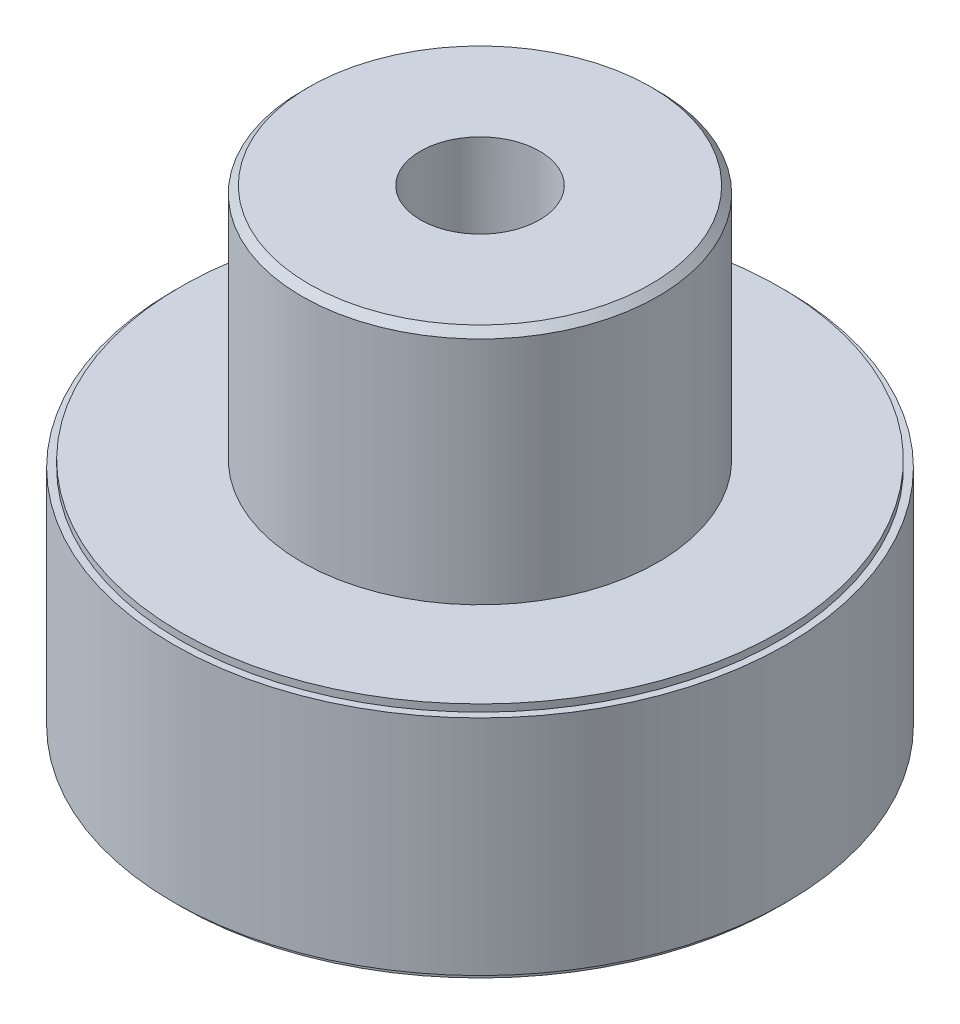
ISO-10303-21;
HEADER;
FILE_DESCRIPTION(('STEP AP214'),'2;1');
FILE_NAME('part.step','',(''),(''),'','','');
FILE_SCHEMA(('AUTOMOTIVE_DESIGN { 1 0 10303 214 1 1 1 1 }'));
ENDSEC;
DATA;
#1=APPLICATION_CONTEXT('core data for automotive mechanical design processes');
#2=APPLICATION_PROTOCOL_DEFINITION('international standard','automotive_design',2000,#1);
#3=PRODUCT_CONTEXT('',#1,'mechanical');
#4=PRODUCT('Part','Part','',(#3));
#5=PRODUCT_RELATED_PRODUCT_CATEGORY('part','',(#4));
#6=PRODUCT_DEFINITION_FORMATION('','',#4);
#7=PRODUCT_DEFINITION_CONTEXT('part definition',#1,'design');
#8=PRODUCT_DEFINITION('design','',#6,#7);
#9=PRODUCT_DEFINITION_SHAPE('','',#8);
#10=(LENGTH_UNIT() NAMED_UNIT(*) SI_UNIT(.MILLI.,.METRE.));
#11=(NAMED_UNIT(*) PLANE_ANGLE_UNIT() SI_UNIT($,.RADIAN.));
#12=(NAMED_UNIT(*) SI_UNIT($,.STERADIAN.) SOLID_ANGLE_UNIT());
#13=UNCERTAINTY_MEASURE_WITH_UNIT(LENGTH_MEASURE(1.E-05),#10,'distance_accuracy_value','');
#14=(GEOMETRIC_REPRESENTATION_CONTEXT(3) GLOBAL_UNCERTAINTY_ASSIGNED_CONTEXT((#13)) GLOBAL_UNIT_ASSIGNED_CONTEXT((#10,
#11,#12)) REPRESENTATION_CONTEXT('',''));
#15=CARTESIAN_POINT('',(0.,0.,0.));
#16=DIRECTION('',(0.,0.,1.));
#17=DIRECTION('',(1.,0.,0.));
#18=AXIS2_PLACEMENT_3D('',#15,#16,#17);
#19=CARTESIAN_POINT('',(0.,12.7,0.));
#20=DIRECTION('',(0.,1.,0.));
#21=DIRECTION('',(0.,0.,1.));
#22=AXIS2_PLACEMENT_3D('',#19,#20,#21);
#23=PLANE('',#22);
#24=CARTESIAN_POINT('',(0.,12.7,0.));
#25=DIRECTION('',(0.,1.,0.));
#26=DIRECTION('',(0.,0.,1.));
#27=AXIS2_PLACEMENT_3D('',#24,#25,#26);
#28=CIRCLE('',#27,16.02);
#29=CARTESIAN_POINT('',(0.,12.7,16.02));
#30=VERTEX_POINT('',#29);
#31=EDGE_CURVE('E53',#30,#30,#28,.T.);
#32=ORIENTED_EDGE('',*,*,#31,.T.);
#33=EDGE_LOOP('',(#32));
#34=FACE_BOUND('',#33,.T.);
#35=CARTESIAN_POINT('',(0.,12.7,0.));
#36=DIRECTION('',(0.,1.,0.));
#37=DIRECTION('',(0.,0.,1.));
#38=AXIS2_PLACEMENT_3D('',#35,#36,#37);
#39=CIRCLE('',#38,9.525);
#40=CARTESIAN_POINT('',(0.,12.7,9.525));
#41=VERTEX_POINT('',#40);
#42=EDGE_CURVE('E62',#41,#41,#39,.T.);
#43=ORIENTED_EDGE('',*,*,#42,.F.);
#44=EDGE_LOOP('',(#43));
#45=FACE_BOUND('',#44,.T.);
#46=ADVANCED_FACE('F31',(#34,#45),#23,.T.);
#47=CARTESIAN_POINT('',(0.,12.32,0.));
#48=DIRECTION('',(0.,1.,0.));
#49=DIRECTION('',(0.,0.,1.));
#50=AXIS2_PLACEMENT_3D('',#47,#48,#49);
#51=PLANE('',#50);
#52=CARTESIAN_POINT('',(0.,12.32,0.));
#53=DIRECTION('',(0.,1.,0.));
#54=DIRECTION('',(0.,0.,1.));
#55=AXIS2_PLACEMENT_3D('',#52,#53,#54);
#56=CIRCLE('',#55,16.4);
#57=CARTESIAN_POINT('',(0.,12.32,16.4));
#58=VERTEX_POINT('',#57);
#59=EDGE_CURVE('E48',#58,#58,#56,.T.);
#60=ORIENTED_EDGE('',*,*,#59,.T.);
#61=EDGE_LOOP('',(#60));
#62=FACE_BOUND('',#61,.T.);
#63=CARTESIAN_POINT('',(0.,12.32,0.));
#64=DIRECTION('',(0.,1.,0.));
#65=DIRECTION('',(0.,0.,1.));
#66=AXIS2_PLACEMENT_3D('',#63,#64,#65);
#67=CIRCLE('',#66,16.02);
#68=CARTESIAN_POINT('',(0.,12.32,16.02));
#69=VERTEX_POINT('',#68);
#70=EDGE_CURVE('E56',#69,#69,#67,.T.);
#71=ORIENTED_EDGE('',*,*,#70,.F.);
#72=EDGE_LOOP('',(#71));
#73=FACE_BOUND('',#72,.T.);
#74=ADVANCED_FACE('F130',(#62,#73),#51,.T.);
#75=CARTESIAN_POINT('',(0.,0.38,0.));
#76=DIRECTION('',(0.,-1.,0.));
#77=DIRECTION('',(0.,0.,-1.));
#78=AXIS2_PLACEMENT_3D('',#75,#76,#77);
#79=CYLINDRICAL_SURFACE('',#78,16.02);
#80=CARTESIAN_POINT('',(0.,0.38,0.));
#81=DIRECTION('',(0.,1.,0.));
#82=DIRECTION('',(0.,0.,1.));
#83=AXIS2_PLACEMENT_3D('',#80,#81,#82);
#84=CIRCLE('',#83,16.02);
#85=CARTESIAN_POINT('',(0.,0.38,16.02));
#86=VERTEX_POINT('',#85);
#87=EDGE_CURVE('E10',#86,#86,#84,.T.);
#88=ORIENTED_EDGE('',*,*,#87,.F.);
#89=EDGE_LOOP('',(#88));
#90=FACE_BOUND('',#89,.T.);
#91=CARTESIAN_POINT('',(0.,0.,0.));
#92=DIRECTION('',(0.,1.,0.));
#93=DIRECTION('',(0.,0.,1.));
#94=AXIS2_PLACEMENT_3D('',#91,#92,#93);
#95=CIRCLE('',#94,16.02);
#96=CARTESIAN_POINT('',(0.,0.,16.02));
#97=VERTEX_POINT('',#96);
#98=EDGE_CURVE('E43',#97,#97,#95,.T.);
#99=ORIENTED_EDGE('',*,*,#98,.T.);
#100=EDGE_LOOP('',(#99));
#101=FACE_BOUND('',#100,.T.);
#102=ADVANCED_FACE('F33',(#90,#101),#79,.T.);
#103=CARTESIAN_POINT('',(0.,0.,0.));
#104=DIRECTION('',(0.,1.,0.));
#105=DIRECTION('',(0.,0.,1.));
#106=AXIS2_PLACEMENT_3D('',#103,#104,#105);
#107=PLANE('',#106);
#108=CARTESIAN_POINT('',(0.,0.,0.));
#109=DIRECTION('',(0.,1.,0.));
#110=DIRECTION('',(0.,0.,1.));
#111=AXIS2_PLACEMENT_3D('',#108,#109,#110);
#112=CIRCLE('',#111,12.7);
#113=CARTESIAN_POINT('',(0.,0.,12.7));
#114=VERTEX_POINT('',#113);
#115=EDGE_CURVE('E79',#114,#114,#112,.T.);
#116=ORIENTED_EDGE('',*,*,#115,.T.);
#117=EDGE_LOOP('',(#116));
#118=FACE_BOUND('',#117,.T.);
#119=ORIENTED_EDGE('',*,*,#98,.F.);
#120=EDGE_LOOP('',(#119));
#121=FACE_BOUND('',#120,.T.);
#122=ADVANCED_FACE('F146',(#118,#121),#107,.F.);
#123=CARTESIAN_POINT('',(0.,0.38,0.));
#124=DIRECTION('',(0.,1.,0.));
#125=DIRECTION('',(0.,0.,1.));
#126=AXIS2_PLACEMENT_3D('',#123,#124,#125);
#127=PLANE('',#126);
#128=CARTESIAN_POINT('',(0.,0.38,0.));
#129=DIRECTION('',(0.,1.,0.));
#130=DIRECTION('',(0.,0.,1.));
#131=AXIS2_PLACEMENT_3D('',#128,#129,#130);
#132=CIRCLE('',#131,16.4);
#133=CARTESIAN_POINT('',(0.,0.38,16.4));
#134=VERTEX_POINT('',#133);
#135=EDGE_CURVE('E50',#134,#134,#132,.T.);
#136=ORIENTED_EDGE('',*,*,#135,.F.);
#137=EDGE_LOOP('',(#136));
#138=FACE_BOUND('',#137,.T.);
#139=ORIENTED_EDGE('',*,*,#87,.T.);
#140=EDGE_LOOP('',(#139));
#141=FACE_BOUND('',#140,.T.);
#142=ADVANCED_FACE('F143',(#138,#141),#127,.F.);
#143=CARTESIAN_POINT('',(0.,12.32,0.));
#144=DIRECTION('',(0.,-1.,0.));
#145=DIRECTION('',(0.,0.,-1.));
#146=AXIS2_PLACEMENT_3D('',#143,#144,#145);
#147=CYLINDRICAL_SURFACE('',#146,16.4);
#148=ORIENTED_EDGE('',*,*,#59,.F.);
#149=EDGE_LOOP('',(#148));
#150=FACE_BOUND('',#149,.T.);
#151=ORIENTED_EDGE('',*,*,#135,.T.);
#152=EDGE_LOOP('',(#151));
#153=FACE_BOUND('',#152,.T.);
#154=ADVANCED_FACE('F140',(#150,#153),#147,.T.);
#155=CARTESIAN_POINT('',(0.,12.7,0.));
#156=DIRECTION('',(0.,-1.,0.));
#157=DIRECTION('',(0.,0.,-1.));
#158=AXIS2_PLACEMENT_3D('',#155,#156,#157);
#159=CYLINDRICAL_SURFACE('',#158,16.02);
#160=ORIENTED_EDGE('',*,*,#31,.F.);
#161=EDGE_LOOP('',(#160));
#162=FACE_BOUND('',#161,.T.);
#163=ORIENTED_EDGE('',*,*,#70,.T.);
#164=EDGE_LOOP('',(#163));
#165=FACE_BOUND('',#164,.T.);
#166=ADVANCED_FACE('F125',(#162,#165),#159,.T.);
#167=CARTESIAN_POINT('',(0.,25.02,0.));
#168=DIRECTION('',(0.,-1.,0.));
#169=DIRECTION('',(0.,0.,-1.));
#170=AXIS2_PLACEMENT_3D('',#167,#168,#169);
#171=CYLINDRICAL_SURFACE('',#170,9.525);
#172=CARTESIAN_POINT('',(0.,20.88,-9.525));
#173=CARTESIAN_POINT('',(-0.112118729840977,20.8799960576349,-9.52499792484135));
#174=CARTESIAN_POINT('',(-0.224285882542196,20.870633863567,-9.52300018602881));
#175=CARTESIAN_POINT('',(-0.445439789810249,20.8334679858441,-9.51522366929871));
#176=CARTESIAN_POINT('',(-0.554424116062384,20.8056505868484,-9.50944207938268));
#177=CARTESIAN_POINT('',(-0.765983763596489,20.7324802448237,-9.49474227650881));
#178=CARTESIAN_POINT('',(-0.868565456041813,20.6871450673453,-9.48582724214025));
#179=CARTESIAN_POINT('',(-1.06466167543459,20.5802811627353,-9.46582526780019));
#180=CARTESIAN_POINT('',(-1.15817654724818,20.51875305185,-9.45473841048476));
#181=CARTESIAN_POINT('',(-1.33490489547487,20.3802636493741,-9.43142177798087));
#182=CARTESIAN_POINT('',(-1.41796144256465,20.3031043463361,-9.41917854029123));
#183=CARTESIAN_POINT('',(-1.57005543122941,20.1359681356262,-9.39502500836399));
#184=CARTESIAN_POINT('',(-1.63909168135584,20.045990139723,-9.38311474249653));
#185=CARTESIAN_POINT('',(-1.76186886482662,19.8546218556228,-9.3608434323561));
#186=CARTESIAN_POINT('',(-1.81544440068863,19.7531232627158,-9.35049966570283));
#187=CARTESIAN_POINT('',(-1.90471889803238,19.5423084342172,-9.33272503047548));
#188=CARTESIAN_POINT('',(-1.94041986004639,19.4329930750481,-9.32529383594493));
#189=CARTESIAN_POINT('',(-1.99241648925041,19.2113451132232,-9.31432252800064));
#190=CARTESIAN_POINT('',(-2.00898910085746,19.0990802828613,-9.31072694130865));
#191=CARTESIAN_POINT('',(-2.02311938992197,18.8733105237592,-9.30766722056046));
#192=CARTESIAN_POINT('',(-2.02067926012294,18.7598057395308,-9.30820261007782));
#193=CARTESIAN_POINT('',(-1.99707658150671,18.5368249004084,-9.31329406143002));
#194=CARTESIAN_POINT('',(-1.97623419226569,18.4273131498611,-9.31778136512509));
#195=CARTESIAN_POINT('',(-1.91692518045701,18.2133768396229,-9.3301624926053));
#196=CARTESIAN_POINT('',(-1.87845762246356,18.1089525502659,-9.33805649719398));
#197=CARTESIAN_POINT('',(-1.78469199210292,17.9072471041554,-9.35643025294113));
#198=CARTESIAN_POINT('',(-1.72926943428993,17.8100256201129,-9.36692901697608));
#199=CARTESIAN_POINT('',(-1.60325468594678,17.6261436092519,-9.38931748894697));
#200=CARTESIAN_POINT('',(-1.53266054537303,17.5394844422818,-9.40120737559799));
#201=CARTESIAN_POINT('',(-1.37660468657699,17.3773422052728,-9.42533446698096));
#202=CARTESIAN_POINT('',(-1.29087035090688,17.3021215949858,-9.43757382373047));
#203=CARTESIAN_POINT('',(-1.10786736773257,17.1670850622776,-9.46080063970167));
#204=CARTESIAN_POINT('',(-1.01059853489063,17.1072693874339,-9.47178807880183));
#205=CARTESIAN_POINT('',(-0.806977841115674,17.0046818108476,-9.49130544797007));
#206=CARTESIAN_POINT('',(-0.700608978846047,16.9619426959927,-9.4998306419322));
#207=CARTESIAN_POINT('',(-0.481978931442427,16.8950162952189,-9.51342751758681));
#208=CARTESIAN_POINT('',(-0.369718552968772,16.8708264765931,-9.51849967074425));
#209=CARTESIAN_POINT('',(-0.1447449252677,16.8420633579262,-9.52455239159244));
#210=CARTESIAN_POINT('',(-0.0320794977117327,16.8371312992975,-9.52560777928885));
#211=CARTESIAN_POINT('',(0.192465416506247,16.8460535752304,-9.52371704751969));
#212=CARTESIAN_POINT('',(0.304344952668881,16.8599067157154,-9.52077118239276));
#213=CARTESIAN_POINT('',(0.522964972511826,16.9057084331514,-9.51125601781325));
#214=CARTESIAN_POINT('',(0.629746337759209,16.9374703306318,-9.50472411711296));
#215=CARTESIAN_POINT('',(0.836466569029961,17.017981925958,-9.48876739223556));
#216=CARTESIAN_POINT('',(0.936404875957305,17.0667330098886,-9.47934233202376));
#217=CARTESIAN_POINT('',(1.12809640179785,17.1805970179649,-9.45845945290722));
#218=CARTESIAN_POINT('',(1.21972042204546,17.2459226138616,-9.44697583008331));
#219=CARTESIAN_POINT('',(1.39083463775514,17.3907995393568,-9.42330509750831));
#220=CARTESIAN_POINT('',(1.4703233560168,17.4703525982739,-9.41111790236155));
#221=CARTESIAN_POINT('',(1.61631672557934,17.6430679057469,-9.3871574188698));
#222=CARTESIAN_POINT('',(1.6825737035749,17.7364412721034,-9.37539489927225));
#223=CARTESIAN_POINT('',(1.79846582202227,17.9332017293712,-9.3538566562662));
#224=CARTESIAN_POINT('',(1.8481016651961,18.0365883966934,-9.3440808488687));
#225=CARTESIAN_POINT('',(1.92901804380533,18.2498959495991,-9.32771249367679));
#226=CARTESIAN_POINT('',(1.96039924436973,18.3597772466992,-9.32110252428936));
#227=CARTESIAN_POINT('',(2.00421455226942,18.5834103919382,-9.31178070629733));
#228=CARTESIAN_POINT('',(2.01665148220984,18.6971616608874,-9.30906827698144));
#229=CARTESIAN_POINT('',(2.02211072834025,18.9228125378909,-9.30788367303269));
#230=CARTESIAN_POINT('',(2.01552522832778,19.0347023885508,-9.30932584175886));
#231=CARTESIAN_POINT('',(1.98399922386447,19.255739682418,-9.31609507134074));
#232=CARTESIAN_POINT('',(1.95905890946518,19.3648871540087,-9.32142209197147));
#233=CARTESIAN_POINT('',(1.89171551403344,19.5770524683133,-9.33532029295431));
#234=CARTESIAN_POINT('',(1.84936624030245,19.6800880883663,-9.3438814706822));
#235=CARTESIAN_POINT('',(1.74845455393173,19.877651156789,-9.36328789147232));
#236=CARTESIAN_POINT('',(1.6898905702042,19.972177779522,-9.37413335584098));
#237=CARTESIAN_POINT('',(1.5568969635314,20.1519801083845,-9.39714448694252));
#238=CARTESIAN_POINT('',(1.48218646338367,20.237045384483,-9.4093313603525));
#239=CARTESIAN_POINT('',(1.31959379927694,20.39356062807,-9.43350620073605));
#240=CARTESIAN_POINT('',(1.2317086032647,20.465007452758,-9.44549412121491));
#241=CARTESIAN_POINT('',(1.04398759089206,20.5930771342451,-9.46809115191828));
#242=CARTESIAN_POINT('',(0.944020665034254,20.6495112139732,-9.47868192958168));
#243=CARTESIAN_POINT('',(0.735819775633375,20.744687491254,-9.49710886211385));
#244=CARTESIAN_POINT('',(0.627593030320445,20.7834449343095,-9.50494738935756));
#245=CARTESIAN_POINT('',(0.432672607720802,20.8350403107021,-9.51554238979875));
#246=CARTESIAN_POINT('',(0.347054485544008,20.8518688077023,-9.51906747337249));
#247=CARTESIAN_POINT('',(0.174300624553832,20.8743499643107,-9.52379703933616));
#248=CARTESIAN_POINT('',(0.0871649457641621,20.8800030649298,-9.5250016132995));
#249=CARTESIAN_POINT('',(0.,20.88,-9.525));
#250=B_SPLINE_CURVE_WITH_KNOTS('',3,(#172,#173,#174,#175,#176,#177,#178,#179,#180,#181,#182,
#183,#184,#185,#186,#187,#188,#189,#190,#191,#192,#193,#194,#195,#196,#197,#198,#199,#200,#201,
#202,#203,#204,#205,#206,#207,#208,#209,#210,#211,#212,#213,#214,#215,#216,#217,#218,#219,#220,
#221,#222,#223,#224,#225,#226,#227,#228,#229,#230,#231,#232,#233,#234,#235,#236,#237,#238,#239,
#240,#241,#242,#243,#244,#245,#246,#247,#248,#249),.UNSPECIFIED.,.T.,.F.,(4,2,2,2,2,2,2,2,2,2,2,
2,2,2,2,2,2,2,2,2,2,2,2,2,2,2,2,2,2,2,2,2,2,2,2,2,2,2,4),(0.,0.336037198709726,
0.672324410092056,1.00827146912247,1.34420574503313,1.6846965323013,2.02521624246977,
2.36925413374282,2.71325351149116,3.05220731956183,3.39112203659625,3.72425405894836,
4.05740376376294,4.39306070863056,4.72876082220145,5.0712727604609,5.41379020299086,
5.75696215263163,6.10008723748863,6.43678875666777,6.77346887449939,7.10670267766186,
7.43996367450383,7.7777385772599,8.11555456379434,8.45919884891505,8.80282860332508,
9.14454499605304,9.48621046970184,9.82088244891971,10.1555509628873,10.4891927750357,
10.8228669259758,11.162894872446,11.5030011941707,11.847201151286,12.1911036835585,
12.4523608365589,12.7136076794532),.UNSPECIFIED.);
#251=CARTESIAN_POINT('',(0.,20.88,-9.525));
#252=VERTEX_POINT('',#251);
#253=EDGE_CURVE('E83',#252,#252,#250,.T.);
#254=ORIENTED_EDGE('',*,*,#253,.T.);
#255=EDGE_LOOP('',(#254));
#256=FACE_BOUND('',#255,.T.);
#257=CARTESIAN_POINT('',(0.,25.02,0.));
#258=DIRECTION('',(0.,1.,0.));
#259=DIRECTION('',(0.,0.,1.));
#260=AXIS2_PLACEMENT_3D('',#257,#258,#259);
#261=CIRCLE('',#260,9.525);
#262=CARTESIAN_POINT('',(0.,25.02,9.525));
#263=VERTEX_POINT('',#262);
#264=EDGE_CURVE('E59',#263,#263,#261,.T.);
#265=ORIENTED_EDGE('',*,*,#264,.F.);
#266=EDGE_LOOP('',(#265));
#267=FACE_BOUND('',#266,.T.);
#268=ORIENTED_EDGE('',*,*,#42,.T.);
#269=EDGE_LOOP('',(#268));
#270=FACE_BOUND('',#269,.T.);
#271=ADVANCED_FACE('F90',(#256,#267,#270),#171,.T.);
#272=CARTESIAN_POINT('',(0.,25.02,0.));
#273=DIRECTION('',(0.,-1.,0.));
#274=DIRECTION('',(0.,0.,1.));
#275=AXIS2_PLACEMENT_3D('',#272,#273,#274);
#276=CONICAL_SURFACE('',#275,9.525,0.78539816339745);
#277=CARTESIAN_POINT('',(0.,25.4,0.));
#278=DIRECTION('',(0.,1.,0.));
#279=DIRECTION('',(0.,0.,1.));
#280=AXIS2_PLACEMENT_3D('',#277,#278,#279);
#281=CIRCLE('',#280,9.145);
#282=CARTESIAN_POINT('',(0.,25.4,9.145));
#283=VERTEX_POINT('',#282);
#284=EDGE_CURVE('E65',#283,#283,#281,.T.);
#285=ORIENTED_EDGE('',*,*,#284,.F.);
#286=EDGE_LOOP('',(#285));
#287=FACE_BOUND('',#286,.T.);
#288=ORIENTED_EDGE('',*,*,#264,.T.);
#289=EDGE_LOOP('',(#288));
#290=FACE_BOUND('',#289,.T.);
#291=ADVANCED_FACE('F118',(#287,#290),#276,.T.);
#292=CARTESIAN_POINT('',(0.,25.4,0.));
#293=DIRECTION('',(0.,1.,0.));
#294=DIRECTION('',(0.,0.,1.));
#295=AXIS2_PLACEMENT_3D('',#292,#293,#294);
#296=PLANE('',#295);
#297=CARTESIAN_POINT('',(0.,25.4,0.));
#298=DIRECTION('',(0.,1.,0.));
#299=DIRECTION('',(0.,0.,1.));
#300=AXIS2_PLACEMENT_3D('',#297,#298,#299);
#301=CIRCLE('',#300,3.19);
#302=CARTESIAN_POINT('',(0.,25.4,3.19));
#303=VERTEX_POINT('',#302);
#304=EDGE_CURVE('E70',#303,#303,#301,.T.);
#305=ORIENTED_EDGE('',*,*,#304,.F.);
#306=EDGE_LOOP('',(#305));
#307=FACE_BOUND('',#306,.T.);
#308=ORIENTED_EDGE('',*,*,#284,.T.);
#309=EDGE_LOOP('',(#308));
#310=FACE_BOUND('',#309,.T.);
#311=ADVANCED_FACE('F115',(#307,#310),#296,.T.);
#312=CARTESIAN_POINT('',(0.,6.35,0.));
#313=DIRECTION('',(0.,1.,0.));
#314=DIRECTION('',(0.,0.,1.));
#315=AXIS2_PLACEMENT_3D('',#312,#313,#314);
#316=CYLINDRICAL_SURFACE('',#315,3.19);
#317=CARTESIAN_POINT('',(2.02,18.86,-2.46894714402718));
#318=CARTESIAN_POINT('',(2.01999052252787,18.7599602881098,-2.46896239622514));
#319=CARTESIAN_POINT('',(2.01250006144808,18.6597781672617,-2.47514224345317));
#320=CARTESIAN_POINT('',(1.98308795028775,18.4628302318332,-2.49875726141145));
#321=CARTESIAN_POINT('',(1.96112931837434,18.3660738433265,-2.51622127317432));
#322=CARTESIAN_POINT('',(1.90437808701033,18.1794249398564,-2.55943167508915));
#323=CARTESIAN_POINT('',(1.86969932265003,18.0894798299912,-2.58510435046628));
#324=CARTESIAN_POINT('',(1.78882239436669,17.9168052439285,-2.64171292638374));
#325=CARTESIAN_POINT('',(1.74262340160001,17.8340762874885,-2.67264920557266));
#326=CARTESIAN_POINT('',(1.63258335892593,17.6656200464064,-2.74144794435599));
#327=CARTESIAN_POINT('',(1.56718659065784,17.5810582561461,-2.77967675875599));
#328=CARTESIAN_POINT('',(1.42377872703368,17.423112868293,-2.85579362986006));
#329=CARTESIAN_POINT('',(1.34575655882781,17.3497391937339,-2.89368135634572));
#330=CARTESIAN_POINT('',(1.16750975093309,17.2071499532047,-2.97044858113412));
#331=CARTESIAN_POINT('',(1.06572871352995,17.139602162739,-3.0088594716437));
#332=CARTESIAN_POINT('',(0.849349015995102,17.0231408351517,-3.07693360544372));
#333=CARTESIAN_POINT('',(0.734763494252285,16.974208420273,-3.10660570376296));
#334=CARTESIAN_POINT('',(0.508562951211093,16.9018471892451,-3.15108538070995));
#335=CARTESIAN_POINT('',(0.397872687020647,16.8762994251423,-3.16711556872112));
#336=CARTESIAN_POINT('',(0.172749637134874,16.8442018257678,-3.18731519003155));
#337=CARTESIAN_POINT('',(0.0583210684523817,16.8376312838507,-3.19149755077294));
#338=CARTESIAN_POINT('',(-0.153993067261685,16.8434722029378,-3.18780346381537));
#339=CARTESIAN_POINT('',(-0.251987610391766,16.8533952520628,-3.18150768774305));
#340=CARTESIAN_POINT('',(-0.444591921042283,16.887110187532,-3.16035142109817));
#341=CARTESIAN_POINT('',(-0.539201432614047,16.9109031202622,-3.14549028432983));
#342=CARTESIAN_POINT('',(-0.722824859723941,16.9712733187307,-3.10844365285633));
#343=CARTESIAN_POINT('',(-0.811830780771611,17.0078683821255,-3.08624796397224));
#344=CARTESIAN_POINT('',(-0.982494300947232,17.0924634693746,-3.03623498876535));
#345=CARTESIAN_POINT('',(-1.06415029347723,17.14046597844,-3.00841647765954));
#346=CARTESIAN_POINT('',(-1.22883589612608,17.2532816083798,-2.94529855288915));
#347=CARTESIAN_POINT('',(-1.31074295507055,17.3194505958859,-2.90949821045178));
#348=CARTESIAN_POINT('',(-1.4630086954523,17.4632203743486,-2.8359958364515));
#349=CARTESIAN_POINT('',(-1.53334996251306,17.5408380760381,-2.79829104697811));
#350=CARTESIAN_POINT('',(-1.67019116320193,17.7176322927032,-2.71911966964007));
#351=CARTESIAN_POINT('',(-1.73487966209271,17.8183049338516,-2.67783547265684));
#352=CARTESIAN_POINT('',(-1.8462081785369,18.0315586861628,-2.60233590841469));
#353=CARTESIAN_POINT('',(-1.89288116684639,18.1441175583058,-2.56810768183073));
#354=CARTESIAN_POINT('',(-1.95592770861599,18.3473254882596,-2.52023324453214));
#355=CARTESIAN_POINT('',(-1.97706807783605,18.4357705949874,-2.50352996693732));
#356=CARTESIAN_POINT('',(-2.00726602575958,18.6158868124742,-2.47938902820257));
#357=CARTESIAN_POINT('',(-2.01634096881996,18.7075530917889,-2.47193805232933));
#358=CARTESIAN_POINT('',(-2.02185641129574,18.8917739167885,-2.46743052477324));
#359=CARTESIAN_POINT('',(-2.01826355638048,18.9843301665815,-2.47040141377183));
#360=CARTESIAN_POINT('',(-1.99861700782918,19.1672605593435,-2.48631831950339));
#361=CARTESIAN_POINT('',(-1.98255291435692,19.257632816182,-2.49927266142811));
#362=CARTESIAN_POINT('',(-1.93938361482385,19.4319120953026,-2.53290528386684));
#363=CARTESIAN_POINT('',(-1.91253122555021,19.5159180622651,-2.55340585887116));
#364=CARTESIAN_POINT('',(-1.84884727297356,19.6784061212992,-2.59988743829461));
#365=CARTESIAN_POINT('',(-1.81201221341416,19.7568862658929,-2.62587036210357));
#366=CARTESIAN_POINT('',(-1.72123836370279,19.922199450548,-2.68643890856478));
#367=CARTESIAN_POINT('',(-1.66537031865137,20.0077189767164,-2.72171686334325));
#368=CARTESIAN_POINT('',(-1.5417346400229,20.1691240809558,-2.79361429814777));
#369=CARTESIAN_POINT('',(-1.47395445758738,20.2449993525618,-2.83023516034454));
#370=CARTESIAN_POINT('',(-1.31473992953773,20.3981982237631,-2.90803765908836));
#371=CARTESIAN_POINT('',(-1.22124268235612,20.4735508197389,-2.948928357779));
#372=CARTESIAN_POINT('',(-1.02051733178236,20.6074180968063,-3.02425438388572));
#373=CARTESIAN_POINT('',(-0.91329454496179,20.665939269182,-3.05869219816016));
#374=CARTESIAN_POINT('',(-0.693686315904434,20.7607112869103,-3.11561372667741));
#375=CARTESIAN_POINT('',(-0.581895974706695,20.7979975574524,-3.13864433569463));
#376=CARTESIAN_POINT('',(-0.351834207598937,20.8526192005224,-3.17265886907056));
#377=CARTESIAN_POINT('',(-0.233572596523703,20.8699839545213,-3.18366053332461));
#378=CARTESIAN_POINT('',(-0.0135471896221445,20.8824906375075,-3.19157644657125));
#379=CARTESIAN_POINT('',(0.0879913923365648,20.8806097330821,-3.19037811246661));
#380=CARTESIAN_POINT('',(0.289078945919023,20.8617549894805,-3.17846934699793));
#381=CARTESIAN_POINT('',(0.388628056464698,20.8447822079402,-3.1677595821932));
#382=CARTESIAN_POINT('',(0.578803197382081,20.7976778294271,-3.13846684319777));
#383=CARTESIAN_POINT('',(0.669628097894464,20.7681217927734,-3.12022919530539));
#384=CARTESIAN_POINT('',(0.844920510904775,20.6972410086156,-3.07739474572141));
#385=CARTESIAN_POINT('',(0.929387028282569,20.6559144237808,-3.0527969512942));
#386=CARTESIAN_POINT('',(1.09887403027134,20.5580585614448,-2.99622210228825));
#387=CARTESIAN_POINT('',(1.18308131184922,20.5004122815194,-2.96374957543489));
#388=CARTESIAN_POINT('',(1.34120896933056,20.3738798114498,-2.895632525741));
#389=CARTESIAN_POINT('',(1.41511786779827,20.3049812635434,-2.85998453524913));
#390=CARTESIAN_POINT('',(1.56198717368996,20.1460759219757,-2.7828316748975));
#391=CARTESIAN_POINT('',(1.6331647796411,20.0544536007316,-2.74124568070044));
#392=CARTESIAN_POINT('',(1.75943189810242,19.8591479586233,-2.66196519610612));
#393=CARTESIAN_POINT('',(1.81452844927763,19.7554699423991,-2.62426900782863));
#394=CARTESIAN_POINT('',(1.89663260998723,19.5612579443684,-2.56531957058622));
#395=CARTESIAN_POINT('',(1.92714061828443,19.4727502992101,-2.54227328916226));
#396=CARTESIAN_POINT('',(1.97575862245427,19.2907907097604,-2.50468395117088));
#397=CARTESIAN_POINT('',(1.99390662175715,19.1973548816265,-2.49011485005073));
#398=CARTESIAN_POINT('',(2.01022780460759,19.0625527932882,-2.4769165248229));
#399=CARTESIAN_POINT('',(2.01388533714535,19.0221986506102,-2.47393967689459));
#400=CARTESIAN_POINT('',(2.01877368876023,18.9412375459554,-2.46995162246112));
#401=CARTESIAN_POINT('',(2.02000384921746,18.9006305183605,-2.46894094944008));
#402=CARTESIAN_POINT('',(2.02,18.86,-2.46894714402718));
#403=B_SPLINE_CURVE_WITH_KNOTS('',3,(#317,#318,#319,#320,#321,#322,#323,#324,#325,#326,#327,
#328,#329,#330,#331,#332,#333,#334,#335,#336,#337,#338,#339,#340,#341,#342,#343,#344,#345,#346,
#347,#348,#349,#350,#351,#352,#353,#354,#355,#356,#357,#358,#359,#360,#361,#362,#363,#364,#365,
#366,#367,#368,#369,#370,#371,#372,#373,#374,#375,#376,#377,#378,#379,#380,#381,#382,#383,#384,
#385,#386,#387,#388,#389,#390,#391,#392,#393,#394,#395,#396,#397,#398,#399,#400,#401,#402),
.UNSPECIFIED.,.T.,.F.,(4,2,2,2,2,2,2,2,2,2,2,2,2,2,2,2,2,2,2,2,2,2,2,2,2,2,2,2,2,2,2,2,2,2,2,2,
2,2,2,2,2,2,4),(0.,0.299932718573629,0.600635079543753,0.898709555611548,1.19680548337672,
1.53609531465734,1.87568434221164,2.25774535911852,2.63941789050238,2.98150032129714,
3.32320935389533,3.61788144833878,3.91257577661512,4.20768143087698,4.50285143550358,
4.83520143015813,5.16804734361908,5.54598589673418,5.9232294554324,6.19945669801919,
6.47528596715246,6.75184203689004,7.02862897634251,7.29927626009233,7.57001845611199,
7.89304246200697,8.21640882037457,8.59507081135675,8.97358656939412,9.33157993768943,
9.6890446339373,9.99216430662479,10.295262738418,10.5857776312638,10.8763378970828,
11.1963766398586,11.5167692572539,11.8849090882444,12.2528875422438,12.5410551435628,
12.8283326641996,12.9501154682755,13.0719313111908),.UNSPECIFIED.);
#404=CARTESIAN_POINT('',(2.02,18.86,-2.46894714402718));
#405=VERTEX_POINT('',#404);
#406=EDGE_CURVE('E35',#405,#405,#403,.T.);
#407=ORIENTED_EDGE('',*,*,#406,.T.);
#408=EDGE_LOOP('',(#407));
#409=FACE_BOUND('',#408,.T.);
#410=CARTESIAN_POINT('',(0.,6.35,0.));
#411=DIRECTION('',(0.,1.,0.));
#412=DIRECTION('',(0.,0.,1.));
#413=AXIS2_PLACEMENT_3D('',#410,#411,#412);
#414=CIRCLE('',#413,3.19);
#415=CARTESIAN_POINT('',(0.,6.35,3.19));
#416=VERTEX_POINT('',#415);
#417=EDGE_CURVE('E73',#416,#416,#414,.F.);
#418=ORIENTED_EDGE('',*,*,#417,.T.);
#419=EDGE_LOOP('',(#418));
#420=FACE_BOUND('',#419,.T.);
#421=ORIENTED_EDGE('',*,*,#304,.T.);
#422=EDGE_LOOP('',(#421));
#423=FACE_BOUND('',#422,.T.);
#424=ADVANCED_FACE('F108',(#409,#420,#423),#316,.F.);
#425=CARTESIAN_POINT('',(0.,6.35,0.));
#426=DIRECTION('',(0.,1.,0.));
#427=DIRECTION('',(0.,0.,1.));
#428=AXIS2_PLACEMENT_3D('',#425,#426,#427);
#429=PLANE('',#428);
#430=CARTESIAN_POINT('',(0.,6.35,0.));
#431=DIRECTION('',(0.,1.,0.));
#432=DIRECTION('',(0.,0.,1.));
#433=AXIS2_PLACEMENT_3D('',#430,#431,#432);
#434=CIRCLE('',#433,12.32);
#435=CARTESIAN_POINT('',(0.,6.35,12.32));
#436=VERTEX_POINT('',#435);
#437=EDGE_CURVE('E76',#436,#436,#434,.T.);
#438=ORIENTED_EDGE('',*,*,#437,.F.);
#439=EDGE_LOOP('',(#438));
#440=FACE_BOUND('',#439,.T.);
#441=ORIENTED_EDGE('',*,*,#417,.F.);
#442=EDGE_LOOP('',(#441));
#443=FACE_BOUND('',#442,.T.);
#444=ADVANCED_FACE('F105',(#440,#443),#429,.F.);
#445=CARTESIAN_POINT('',(0.,6.35,0.));
#446=DIRECTION('',(0.,-1.,0.));
#447=DIRECTION('',(0.,0.,1.));
#448=AXIS2_PLACEMENT_3D('',#445,#446,#447);
#449=CONICAL_SURFACE('',#448,12.32,0.78539816339745);
#450=CARTESIAN_POINT('',(0.,5.97,0.));
#451=DIRECTION('',(0.,1.,0.));
#452=DIRECTION('',(0.,0.,1.));
#453=AXIS2_PLACEMENT_3D('',#450,#451,#452);
#454=CIRCLE('',#453,12.7);
#455=CARTESIAN_POINT('',(0.,5.97,12.7));
#456=VERTEX_POINT('',#455);
#457=EDGE_CURVE('E80',#456,#456,#454,.T.);
#458=ORIENTED_EDGE('',*,*,#457,.F.);
#459=EDGE_LOOP('',(#458));
#460=FACE_BOUND('',#459,.T.);
#461=ORIENTED_EDGE('',*,*,#437,.T.);
#462=EDGE_LOOP('',(#461));
#463=FACE_BOUND('',#462,.T.);
#464=ADVANCED_FACE('F103',(#460,#463),#449,.F.);
#465=CARTESIAN_POINT('',(0.,0.,0.));
#466=DIRECTION('',(0.,1.,0.));
#467=DIRECTION('',(0.,0.,1.));
#468=AXIS2_PLACEMENT_3D('',#465,#466,#467);
#469=CYLINDRICAL_SURFACE('',#468,12.7);
#470=ORIENTED_EDGE('',*,*,#115,.F.);
#471=EDGE_LOOP('',(#470));
#472=FACE_BOUND('',#471,.T.);
#473=ORIENTED_EDGE('',*,*,#457,.T.);
#474=EDGE_LOOP('',(#473));
#475=FACE_BOUND('',#474,.T.);
#476=ADVANCED_FACE('F98',(#472,#475),#469,.F.);
#477=CARTESIAN_POINT('',(0.,18.86,-10.97));
#478=DIRECTION('',(0.,0.,1.));
#479=DIRECTION('',(1.,0.,0.));
#480=AXIS2_PLACEMENT_3D('',#477,#478,#479);
#481=CYLINDRICAL_SURFACE('',#480,2.02);
#482=ORIENTED_EDGE('',*,*,#406,.F.);
#483=EDGE_LOOP('',(#482));
#484=FACE_BOUND('',#483,.T.);
#485=ORIENTED_EDGE('',*,*,#253,.F.);
#486=EDGE_LOOP('',(#485));
#487=FACE_BOUND('',#486,.T.);
#488=ADVANCED_FACE('F94',(#484,#487),#481,.F.);
#489=CLOSED_SHELL('',(#46,#74,#102,#122,#142,#154,#166,#271,#291,#311,#424,#444,#464,#476,#488));
#490=MANIFOLD_SOLID_BREP('B2',#489);
#491=ADVANCED_BREP_SHAPE_REPRESENTATION('',(#18,#490),#14);
#492=SHAPE_DEFINITION_REPRESENTATION(#9,#491);
ENDSEC;
END-ISO-10303-21;
